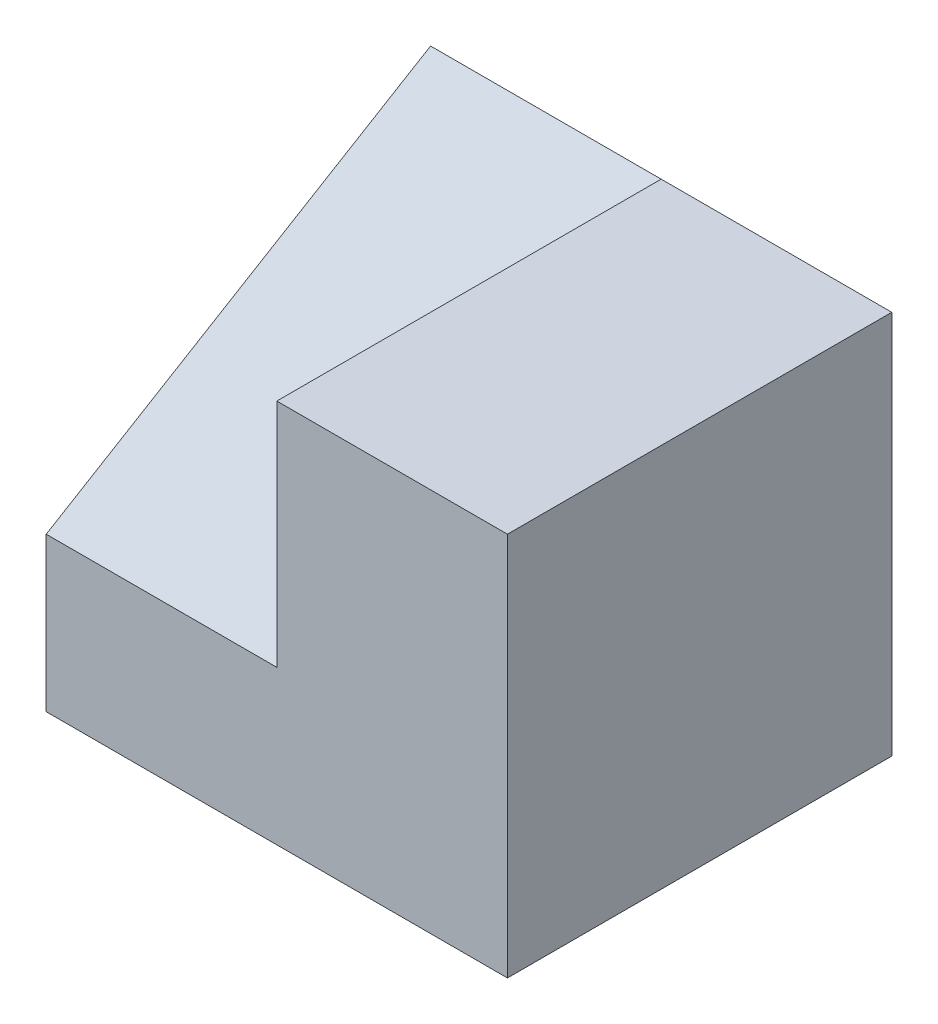
ISO-10303-21;
HEADER;
FILE_DESCRIPTION(('STEP AP214'),'2;1');
FILE_NAME('part.step','',(''),(''),'','','');
FILE_SCHEMA(('AUTOMOTIVE_DESIGN { 1 0 10303 214 1 1 1 1 }'));
ENDSEC;
DATA;
#1=APPLICATION_CONTEXT('core data for automotive mechanical design processes');
#2=APPLICATION_PROTOCOL_DEFINITION('international standard','automotive_design',2000,#1);
#3=PRODUCT_CONTEXT('',#1,'mechanical');
#4=PRODUCT('Part','Part','',(#3));
#5=PRODUCT_RELATED_PRODUCT_CATEGORY('part','',(#4));
#6=PRODUCT_DEFINITION_FORMATION('','',#4);
#7=PRODUCT_DEFINITION_CONTEXT('part definition',#1,'design');
#8=PRODUCT_DEFINITION('design','',#6,#7);
#9=PRODUCT_DEFINITION_SHAPE('','',#8);
#10=(LENGTH_UNIT() NAMED_UNIT(*) SI_UNIT(.MILLI.,.METRE.));
#11=(NAMED_UNIT(*) PLANE_ANGLE_UNIT() SI_UNIT($,.RADIAN.));
#12=(NAMED_UNIT(*) SI_UNIT($,.STERADIAN.) SOLID_ANGLE_UNIT());
#13=UNCERTAINTY_MEASURE_WITH_UNIT(LENGTH_MEASURE(1.E-05),#10,'distance_accuracy_value','');
#14=(GEOMETRIC_REPRESENTATION_CONTEXT(3) GLOBAL_UNCERTAINTY_ASSIGNED_CONTEXT((#13)) GLOBAL_UNIT_ASSIGNED_CONTEXT((#10,
#11,#12)) REPRESENTATION_CONTEXT('',''));
#15=CARTESIAN_POINT('',(0.,0.,0.));
#16=DIRECTION('',(0.,0.,1.));
#17=DIRECTION('',(1.,0.,0.));
#18=AXIS2_PLACEMENT_3D('',#15,#16,#17);
#19=CARTESIAN_POINT('',(-15.,10.,25.));
#20=DIRECTION('',(1.,0.,0.));
#21=DIRECTION('',(0.,0.,-1.));
#22=AXIS2_PLACEMENT_3D('',#19,#20,#21);
#23=PLANE('',#22);
#24=DIRECTION('',(0.,0.514495755427527,-0.857492925712544));
#25=VECTOR('',#24,1.);
#26=CARTESIAN_POINT('',(-15.,25.,0.));
#27=LINE('',#26,#25);
#28=CARTESIAN_POINT('',(-15.,10.,25.));
#29=VERTEX_POINT('',#28);
#30=CARTESIAN_POINT('',(-15.,25.,0.));
#31=VERTEX_POINT('',#30);
#32=EDGE_CURVE('E108',#29,#31,#27,.T.);
#33=ORIENTED_EDGE('',*,*,#32,.F.);
#34=DIRECTION('',(0.,-1.,0.));
#35=VECTOR('',#34,1.);
#36=CARTESIAN_POINT('',(-15.,10.,25.));
#37=LINE('',#36,#35);
#38=CARTESIAN_POINT('',(-15.,25.,25.));
#39=VERTEX_POINT('',#38);
#40=EDGE_CURVE('E97',#39,#29,#37,.T.);
#41=ORIENTED_EDGE('',*,*,#40,.F.);
#42=DIRECTION('',(0.,0.,-1.));
#43=VECTOR('',#42,1.);
#44=CARTESIAN_POINT('',(-15.,25.,25.));
#45=LINE('',#44,#43);
#46=EDGE_CURVE('E102',#39,#31,#45,.T.);
#47=ORIENTED_EDGE('',*,*,#46,.T.);
#48=EDGE_LOOP('',(#33,#41,#47));
#49=FACE_BOUND('',#48,.T.);
#50=ADVANCED_FACE('F33',(#49),#23,.F.);
#51=CARTESIAN_POINT('',(-30.,0.,25.));
#52=DIRECTION('',(1.,0.,0.));
#53=DIRECTION('',(0.,0.,-1.));
#54=AXIS2_PLACEMENT_3D('',#51,#52,#53);
#55=PLANE('',#54);
#56=DIRECTION('',(0.,-1.,0.));
#57=VECTOR('',#56,1.);
#58=CARTESIAN_POINT('',(-30.,0.,0.));
#59=LINE('',#58,#57);
#60=CARTESIAN_POINT('',(-30.,25.,0.));
#61=VERTEX_POINT('',#60);
#62=CARTESIAN_POINT('',(-30.,15.,0.));
#63=VERTEX_POINT('',#62);
#64=EDGE_CURVE('E113',#61,#63,#59,.T.);
#65=ORIENTED_EDGE('',*,*,#64,.T.);
#66=DIRECTION('',(0.,0.,-1.));
#67=VECTOR('',#66,1.);
#68=CARTESIAN_POINT('',(-30.,15.,15.));
#69=LINE('',#68,#67);
#70=CARTESIAN_POINT('',(-30.,15.,15.));
#71=VERTEX_POINT('',#70);
#72=EDGE_CURVE('E48',#71,#63,#69,.T.);
#73=ORIENTED_EDGE('',*,*,#72,.F.);
#74=DIRECTION('',(0.,1.,0.));
#75=VECTOR('',#74,1.);
#76=CARTESIAN_POINT('',(-30.,15.,15.));
#77=LINE('',#76,#75);
#78=CARTESIAN_POINT('',(-30.,0.,15.));
#79=VERTEX_POINT('',#78);
#80=EDGE_CURVE('E149',#79,#71,#77,.T.);
#81=ORIENTED_EDGE('',*,*,#80,.F.);
#82=DIRECTION('',(0.,0.,-1.));
#83=VECTOR('',#82,1.);
#84=CARTESIAN_POINT('',(-30.,0.,25.));
#85=LINE('',#84,#83);
#86=CARTESIAN_POINT('',(-30.,0.,25.));
#87=VERTEX_POINT('',#86);
#88=EDGE_CURVE('E11',#87,#79,#85,.T.);
#89=ORIENTED_EDGE('',*,*,#88,.F.);
#90=DIRECTION('',(0.,-1.,0.));
#91=VECTOR('',#90,1.);
#92=CARTESIAN_POINT('',(-30.,0.,25.));
#93=LINE('',#92,#91);
#94=CARTESIAN_POINT('',(-30.,10.,25.));
#95=VERTEX_POINT('',#94);
#96=EDGE_CURVE('E121',#95,#87,#93,.T.);
#97=ORIENTED_EDGE('',*,*,#96,.F.);
#98=DIRECTION('',(0.,0.514495755427527,-0.857492925712544));
#99=VECTOR('',#98,1.);
#100=CARTESIAN_POINT('',(-30.,25.,0.));
#101=LINE('',#100,#99);
#102=EDGE_CURVE('E138',#95,#61,#101,.T.);
#103=ORIENTED_EDGE('',*,*,#102,.T.);
#104=EDGE_LOOP('',(#65,#73,#81,#89,#97,#103));
#105=FACE_BOUND('',#104,.T.);
#106=ADVANCED_FACE('F35',(#105),#55,.F.);
#107=CARTESIAN_POINT('',(0.,0.,25.));
#108=DIRECTION('',(0.,1.,0.));
#109=DIRECTION('',(-1.,0.,0.));
#110=AXIS2_PLACEMENT_3D('',#107,#108,#109);
#111=PLANE('',#110);
#112=DIRECTION('',(-1.,0.,0.));
#113=VECTOR('',#112,1.);
#114=CARTESIAN_POINT('',(-30.,0.,15.));
#115=LINE('',#114,#113);
#116=CARTESIAN_POINT('',(-15.,0.,15.));
#117=VERTEX_POINT('',#116);
#118=EDGE_CURVE('E155',#117,#79,#115,.T.);
#119=ORIENTED_EDGE('',*,*,#118,.F.);
#120=DIRECTION('',(0.,0.,-1.));
#121=VECTOR('',#120,1.);
#122=CARTESIAN_POINT('',(-15.,0.,15.));
#123=LINE('',#122,#121);
#124=CARTESIAN_POINT('',(-15.,0.,0.));
#125=VERTEX_POINT('',#124);
#126=EDGE_CURVE('E177',#117,#125,#123,.T.);
#127=ORIENTED_EDGE('',*,*,#126,.T.);
#128=DIRECTION('',(1.,0.,0.));
#129=VECTOR('',#128,1.);
#130=CARTESIAN_POINT('',(0.,0.,0.));
#131=LINE('',#130,#129);
#132=CARTESIAN_POINT('',(0.,0.,0.));
#133=VERTEX_POINT('',#132);
#134=EDGE_CURVE('E116',#125,#133,#131,.T.);
#135=ORIENTED_EDGE('',*,*,#134,.T.);
#136=DIRECTION('',(0.,0.,-1.));
#137=VECTOR('',#136,1.);
#138=CARTESIAN_POINT('',(0.,0.,25.));
#139=LINE('',#138,#137);
#140=CARTESIAN_POINT('',(0.,0.,25.));
#141=VERTEX_POINT('',#140);
#142=EDGE_CURVE('E41',#141,#133,#139,.T.);
#143=ORIENTED_EDGE('',*,*,#142,.F.);
#144=DIRECTION('',(1.,0.,0.));
#145=VECTOR('',#144,1.);
#146=CARTESIAN_POINT('',(0.,0.,25.));
#147=LINE('',#146,#145);
#148=EDGE_CURVE('E85',#87,#141,#147,.T.);
#149=ORIENTED_EDGE('',*,*,#148,.F.);
#150=ORIENTED_EDGE('',*,*,#88,.T.);
#151=EDGE_LOOP('',(#119,#127,#135,#143,#149,#150));
#152=FACE_BOUND('',#151,.T.);
#153=ADVANCED_FACE('F151',(#152),#111,.F.);
#154=CARTESIAN_POINT('',(0.,25.,25.));
#155=DIRECTION('',(-1.,0.,0.));
#156=DIRECTION('',(0.,-1.,0.));
#157=AXIS2_PLACEMENT_3D('',#154,#155,#156);
#158=PLANE('',#157);
#159=DIRECTION('',(0.,1.,0.));
#160=VECTOR('',#159,1.);
#161=CARTESIAN_POINT('',(0.,25.,0.));
#162=LINE('',#161,#160);
#163=CARTESIAN_POINT('',(0.,25.,0.));
#164=VERTEX_POINT('',#163);
#165=EDGE_CURVE('E119',#133,#164,#162,.T.);
#166=ORIENTED_EDGE('',*,*,#165,.T.);
#167=DIRECTION('',(0.,0.,-1.));
#168=VECTOR('',#167,1.);
#169=CARTESIAN_POINT('',(0.,25.,25.));
#170=LINE('',#169,#168);
#171=CARTESIAN_POINT('',(0.,25.,25.));
#172=VERTEX_POINT('',#171);
#173=EDGE_CURVE('E106',#172,#164,#170,.T.);
#174=ORIENTED_EDGE('',*,*,#173,.F.);
#175=DIRECTION('',(0.,1.,0.));
#176=VECTOR('',#175,1.);
#177=CARTESIAN_POINT('',(0.,25.,25.));
#178=LINE('',#177,#176);
#179=EDGE_CURVE('E99',#141,#172,#178,.T.);
#180=ORIENTED_EDGE('',*,*,#179,.F.);
#181=ORIENTED_EDGE('',*,*,#142,.T.);
#182=EDGE_LOOP('',(#166,#174,#180,#181));
#183=FACE_BOUND('',#182,.T.);
#184=ADVANCED_FACE('F126',(#183),#158,.F.);
#185=CARTESIAN_POINT('',(-15.,25.,25.));
#186=DIRECTION('',(0.,-1.,0.));
#187=DIRECTION('',(0.,0.,-1.));
#188=AXIS2_PLACEMENT_3D('',#185,#186,#187);
#189=PLANE('',#188);
#190=DIRECTION('',(-1.,0.,0.));
#191=VECTOR('',#190,1.);
#192=CARTESIAN_POINT('',(-15.,25.,0.));
#193=LINE('',#192,#191);
#194=EDGE_CURVE('E77',#164,#31,#193,.T.);
#195=ORIENTED_EDGE('',*,*,#194,.T.);
#196=ORIENTED_EDGE('',*,*,#46,.F.);
#197=DIRECTION('',(-1.,0.,0.));
#198=VECTOR('',#197,1.);
#199=CARTESIAN_POINT('',(-15.,25.,25.));
#200=LINE('',#199,#198);
#201=EDGE_CURVE('E94',#172,#39,#200,.T.);
#202=ORIENTED_EDGE('',*,*,#201,.F.);
#203=ORIENTED_EDGE('',*,*,#173,.T.);
#204=EDGE_LOOP('',(#195,#196,#202,#203));
#205=FACE_BOUND('',#204,.T.);
#206=ADVANCED_FACE('F103',(#205),#189,.F.);
#207=CARTESIAN_POINT('',(0.,0.,25.));
#208=DIRECTION('',(0.,0.,-1.));
#209=DIRECTION('',(-1.,0.,0.));
#210=AXIS2_PLACEMENT_3D('',#207,#208,#209);
#211=PLANE('',#210);
#212=ORIENTED_EDGE('',*,*,#96,.T.);
#213=ORIENTED_EDGE('',*,*,#148,.T.);
#214=ORIENTED_EDGE('',*,*,#179,.T.);
#215=ORIENTED_EDGE('',*,*,#201,.T.);
#216=ORIENTED_EDGE('',*,*,#40,.T.);
#217=DIRECTION('',(-1.,0.,0.));
#218=VECTOR('',#217,1.);
#219=CARTESIAN_POINT('',(-30.,10.,25.));
#220=LINE('',#219,#218);
#221=EDGE_CURVE('E57',#29,#95,#220,.T.);
#222=ORIENTED_EDGE('',*,*,#221,.T.);
#223=EDGE_LOOP('',(#212,#213,#214,#215,#216,#222));
#224=FACE_BOUND('',#223,.T.);
#225=ADVANCED_FACE('F95',(#224),#211,.F.);
#226=CARTESIAN_POINT('',(0.,0.,0.));
#227=DIRECTION('',(0.,0.,-1.));
#228=DIRECTION('',(-1.,0.,0.));
#229=AXIS2_PLACEMENT_3D('',#226,#227,#228);
#230=PLANE('',#229);
#231=DIRECTION('',(0.,-1.,0.));
#232=VECTOR('',#231,1.);
#233=CARTESIAN_POINT('',(-15.,0.,0.));
#234=LINE('',#233,#232);
#235=CARTESIAN_POINT('',(-15.,15.,0.));
#236=VERTEX_POINT('',#235);
#237=EDGE_CURVE('E174',#236,#125,#234,.T.);
#238=ORIENTED_EDGE('',*,*,#237,.F.);
#239=DIRECTION('',(1.,0.,0.));
#240=VECTOR('',#239,1.);
#241=CARTESIAN_POINT('',(-15.,15.,0.));
#242=LINE('',#241,#240);
#243=EDGE_CURVE('E179',#63,#236,#242,.T.);
#244=ORIENTED_EDGE('',*,*,#243,.F.);
#245=ORIENTED_EDGE('',*,*,#64,.F.);
#246=DIRECTION('',(1.,0.,0.));
#247=VECTOR('',#246,1.);
#248=CARTESIAN_POINT('',(-30.,25.,0.));
#249=LINE('',#248,#247);
#250=EDGE_CURVE('E117',#61,#31,#249,.T.);
#251=ORIENTED_EDGE('',*,*,#250,.T.);
#252=ORIENTED_EDGE('',*,*,#194,.F.);
#253=ORIENTED_EDGE('',*,*,#165,.F.);
#254=ORIENTED_EDGE('',*,*,#134,.F.);
#255=EDGE_LOOP('',(#238,#244,#245,#251,#252,#253,#254));
#256=FACE_BOUND('',#255,.T.);
#257=ADVANCED_FACE('F130',(#256),#230,.T.);
#258=CARTESIAN_POINT('',(-30.,25.,0.));
#259=DIRECTION('',(0.,-0.857492925712544,-0.514495755427527));
#260=DIRECTION('',(0.,0.514495755427527,-0.857492925712544));
#261=AXIS2_PLACEMENT_3D('',#258,#259,#260);
#262=PLANE('',#261);
#263=ORIENTED_EDGE('',*,*,#32,.T.);
#264=ORIENTED_EDGE('',*,*,#250,.F.);
#265=ORIENTED_EDGE('',*,*,#102,.F.);
#266=ORIENTED_EDGE('',*,*,#221,.F.);
#267=EDGE_LOOP('',(#263,#264,#265,#266));
#268=FACE_BOUND('',#267,.T.);
#269=ADVANCED_FACE('F191',(#268),#262,.F.);
#270=CARTESIAN_POINT('',(-15.,0.,15.));
#271=DIRECTION('',(1.,0.,0.));
#272=DIRECTION('',(0.,0.,-1.));
#273=AXIS2_PLACEMENT_3D('',#270,#271,#272);
#274=PLANE('',#273);
#275=ORIENTED_EDGE('',*,*,#237,.T.);
#276=ORIENTED_EDGE('',*,*,#126,.F.);
#277=DIRECTION('',(0.,-1.,0.));
#278=VECTOR('',#277,1.);
#279=CARTESIAN_POINT('',(-15.,0.,15.));
#280=LINE('',#279,#278);
#281=CARTESIAN_POINT('',(-15.,15.,15.));
#282=VERTEX_POINT('',#281);
#283=EDGE_CURVE('E175',#282,#117,#280,.T.);
#284=ORIENTED_EDGE('',*,*,#283,.F.);
#285=DIRECTION('',(0.,0.,-1.));
#286=VECTOR('',#285,1.);
#287=CARTESIAN_POINT('',(-15.,15.,15.));
#288=LINE('',#287,#286);
#289=EDGE_CURVE('E172',#282,#236,#288,.T.);
#290=ORIENTED_EDGE('',*,*,#289,.T.);
#291=EDGE_LOOP('',(#275,#276,#284,#290));
#292=FACE_BOUND('',#291,.T.);
#293=ADVANCED_FACE('F173',(#292),#274,.F.);
#294=CARTESIAN_POINT('',(-15.,15.,15.));
#295=DIRECTION('',(0.,1.,0.));
#296=DIRECTION('',(0.,0.,1.));
#297=AXIS2_PLACEMENT_3D('',#294,#295,#296);
#298=PLANE('',#297);
#299=ORIENTED_EDGE('',*,*,#243,.T.);
#300=ORIENTED_EDGE('',*,*,#289,.F.);
#301=DIRECTION('',(1.,0.,0.));
#302=VECTOR('',#301,1.);
#303=CARTESIAN_POINT('',(-15.,15.,15.));
#304=LINE('',#303,#302);
#305=EDGE_CURVE('E187',#71,#282,#304,.T.);
#306=ORIENTED_EDGE('',*,*,#305,.F.);
#307=ORIENTED_EDGE('',*,*,#72,.T.);
#308=EDGE_LOOP('',(#299,#300,#306,#307));
#309=FACE_BOUND('',#308,.T.);
#310=ADVANCED_FACE('F180',(#309),#298,.F.);
#311=CARTESIAN_POINT('',(0.,0.,15.));
#312=DIRECTION('',(0.,0.,1.));
#313=DIRECTION('',(1.,0.,0.));
#314=AXIS2_PLACEMENT_3D('',#311,#312,#313);
#315=PLANE('',#314);
#316=ORIENTED_EDGE('',*,*,#118,.T.);
#317=ORIENTED_EDGE('',*,*,#80,.T.);
#318=ORIENTED_EDGE('',*,*,#305,.T.);
#319=ORIENTED_EDGE('',*,*,#283,.T.);
#320=EDGE_LOOP('',(#316,#317,#318,#319));
#321=FACE_BOUND('',#320,.T.);
#322=ADVANCED_FACE('F190',(#321),#315,.F.);
#323=CLOSED_SHELL('',(#50,#106,#153,#184,#206,#225,#257,#269,#293,#310,#322));
#324=MANIFOLD_SOLID_BREP('B2',#323);
#325=ADVANCED_BREP_SHAPE_REPRESENTATION('',(#18,#324),#14);
#326=SHAPE_DEFINITION_REPRESENTATION(#9,#325);
ENDSEC;
END-ISO-10303-21;
